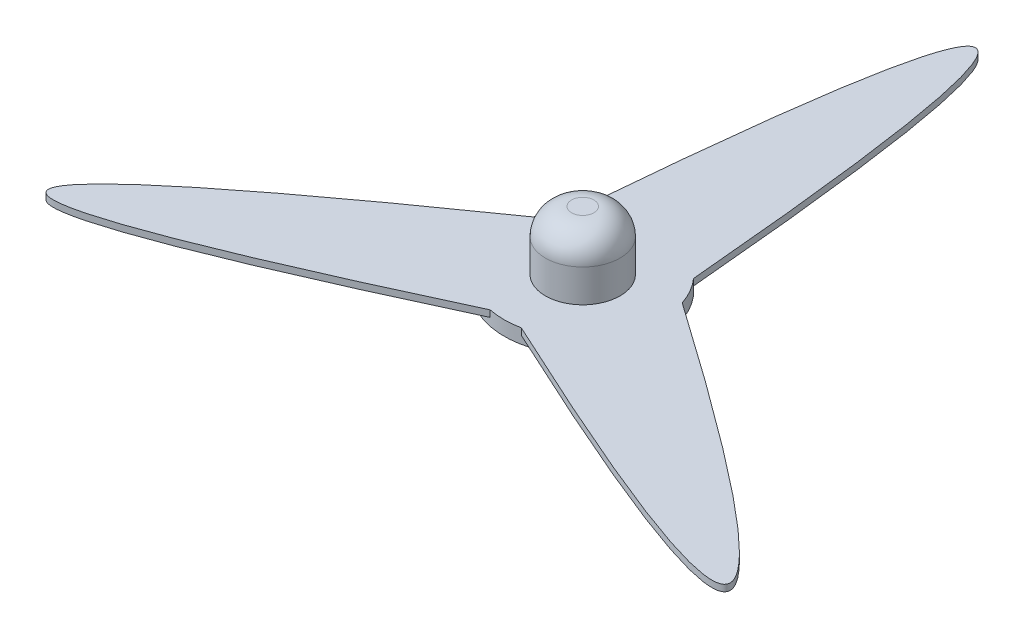
ISO-10303-21;
HEADER;
FILE_DESCRIPTION(('STEP AP214'),'2;1');
FILE_NAME('part.step','',(''),(''),'','','');
FILE_SCHEMA(('AUTOMOTIVE_DESIGN { 1 0 10303 214 1 1 1 1 }'));
ENDSEC;
DATA;
#1=APPLICATION_CONTEXT('core data for automotive mechanical design processes');
#2=APPLICATION_PROTOCOL_DEFINITION('international standard','automotive_design',2000,#1);
#3=PRODUCT_CONTEXT('',#1,'mechanical');
#4=PRODUCT('Part','Part','',(#3));
#5=PRODUCT_RELATED_PRODUCT_CATEGORY('part','',(#4));
#6=PRODUCT_DEFINITION_FORMATION('','',#4);
#7=PRODUCT_DEFINITION_CONTEXT('part definition',#1,'design');
#8=PRODUCT_DEFINITION('design','',#6,#7);
#9=PRODUCT_DEFINITION_SHAPE('','',#8);
#10=(LENGTH_UNIT() NAMED_UNIT(*) SI_UNIT(.MILLI.,.METRE.));
#11=(NAMED_UNIT(*) PLANE_ANGLE_UNIT() SI_UNIT($,.RADIAN.));
#12=(NAMED_UNIT(*) SI_UNIT($,.STERADIAN.) SOLID_ANGLE_UNIT());
#13=UNCERTAINTY_MEASURE_WITH_UNIT(LENGTH_MEASURE(1.E-05),#10,'distance_accuracy_value','');
#14=(GEOMETRIC_REPRESENTATION_CONTEXT(3) GLOBAL_UNCERTAINTY_ASSIGNED_CONTEXT((#13)) GLOBAL_UNIT_ASSIGNED_CONTEXT((#10,
#11,#12)) REPRESENTATION_CONTEXT('',''));
#15=CARTESIAN_POINT('',(0.,0.,0.));
#16=DIRECTION('',(0.,0.,1.));
#17=DIRECTION('',(1.,0.,0.));
#18=AXIS2_PLACEMENT_3D('',#15,#16,#17);
#19=CARTESIAN_POINT('',(0.,0.,-300.));
#20=DIRECTION('',(0.,1.,0.));
#21=DIRECTION('',(0.,0.,1.));
#22=AXIS2_PLACEMENT_3D('',#19,#20,#21);
#23=PLANE('',#22);
#24=CARTESIAN_POINT('',(0.,0.,0.));
#25=DIRECTION('',(0.,-1.,0.));
#26=DIRECTION('',(0.,0.,-1.));
#27=AXIS2_PLACEMENT_3D('',#24,#25,#26);
#28=CIRCLE('',#27,60.);
#29=CARTESIAN_POINT('',(56.8693177121689,0.,-19.1280083373151));
#30=VERTEX_POINT('',#29);
#31=CARTESIAN_POINT('',(11.8693177121685,0.,58.8142780032842));
#32=VERTEX_POINT('',#31);
#33=EDGE_CURVE('E11',#30,#32,#28,.T.);
#34=ORIENTED_EDGE('',*,*,#33,.F.);
#35=CARTESIAN_POINT('',(11.8693177121685,0.,58.8142780032842));
#36=CARTESIAN_POINT('',(485.245924558493,0.,280.156865167018));
#37=CARTESIAN_POINT('',(56.8693177121689,0.,-19.1280083373151));
#38=B_SPLINE_CURVE_WITH_KNOTS('',2,(#35,#36,#37),.UNSPECIFIED.,.F.,.F.,(3,3),(0.,1.),.UNSPECIFIED.);
#39=EDGE_CURVE('E142',#32,#30,#38,.T.);
#40=ORIENTED_EDGE('',*,*,#39,.F.);
#41=EDGE_LOOP('',(#34,#40));
#42=FACE_BOUND('',#41,.T.);
#43=ADVANCED_FACE('F32',(#42),#23,.F.);
#44=CARTESIAN_POINT('',(-11.8693177121693,0.,58.8142780032841));
#45=VERTEX_POINT('',#44);
#46=CARTESIAN_POINT('',(-56.8693177121686,0.,-19.1280083373158));
#47=VERTEX_POINT('',#46);
#48=EDGE_CURVE('E42',#45,#47,#28,.T.);
#49=ORIENTED_EDGE('',*,*,#48,.F.);
#50=CARTESIAN_POINT('',(-56.8693177121686,0.,-19.1280083373158));
#51=CARTESIAN_POINT('',(-485.245924558497,0.,280.156865167011));
#52=CARTESIAN_POINT('',(-11.8693177121693,0.,58.8142780032841));
#53=B_SPLINE_CURVE_WITH_KNOTS('',2,(#50,#51,#52),.UNSPECIFIED.,.F.,.F.,(3,3),(0.,1.),.UNSPECIFIED.);
#54=EDGE_CURVE('E209',#47,#45,#53,.T.);
#55=ORIENTED_EDGE('',*,*,#54,.F.);
#56=EDGE_LOOP('',(#49,#55));
#57=FACE_BOUND('',#56,.T.);
#58=ADVANCED_FACE('F182',(#57),#23,.F.);
#59=CARTESIAN_POINT('',(-45.,0.,-39.6862696659689));
#60=VERTEX_POINT('',#59);
#61=CARTESIAN_POINT('',(45.,0.,-39.6862696659689));
#62=VERTEX_POINT('',#61);
#63=EDGE_CURVE('E197',#60,#62,#28,.T.);
#64=ORIENTED_EDGE('',*,*,#63,.F.);
#65=CARTESIAN_POINT('',(45.,0.,-39.6862696659689));
#66=CARTESIAN_POINT('',(0.,0.,-560.313730334031));
#67=CARTESIAN_POINT('',(-45.,0.,-39.6862696659689));
#68=B_SPLINE_CURVE_WITH_KNOTS('',2,(#65,#66,#67),.UNSPECIFIED.,.F.,.F.,(3,3),(0.,1.),.UNSPECIFIED.);
#69=EDGE_CURVE('E149',#62,#60,#68,.T.);
#70=ORIENTED_EDGE('',*,*,#69,.F.);
#71=EDGE_LOOP('',(#64,#70));
#72=FACE_BOUND('',#71,.T.);
#73=ADVANCED_FACE('F183',(#72),#23,.F.);
#74=CARTESIAN_POINT('',(0.,30.,0.));
#75=DIRECTION('',(0.,1.,0.));
#76=DIRECTION('',(0.,0.,1.));
#77=AXIS2_PLACEMENT_3D('',#74,#75,#76);
#78=DEGENERATE_TOROIDAL_SURFACE('',#77,8.5,20.,.T.);
#79=CARTESIAN_POINT('',(0.,50.,0.));
#80=DIRECTION('',(0.,1.,0.));
#81=DIRECTION('',(0.,0.,1.));
#82=AXIS2_PLACEMENT_3D('',#79,#80,#81);
#83=CIRCLE('',#82,8.5);
#84=CARTESIAN_POINT('',(0.,50.,8.5));
#85=VERTEX_POINT('',#84);
#86=EDGE_CURVE('E206',#85,#85,#83,.T.);
#87=ORIENTED_EDGE('',*,*,#86,.F.);
#88=EDGE_LOOP('',(#87));
#89=FACE_BOUND('',#88,.T.);
#90=CARTESIAN_POINT('',(0.,30.,0.));
#91=DIRECTION('',(0.,1.,0.));
#92=DIRECTION('',(0.,0.,1.));
#93=AXIS2_PLACEMENT_3D('',#90,#91,#92);
#94=CIRCLE('',#93,28.5);
#95=CARTESIAN_POINT('',(0.,30.,28.5));
#96=VERTEX_POINT('',#95);
#97=EDGE_CURVE('E200',#96,#96,#94,.F.);
#98=ORIENTED_EDGE('',*,*,#97,.F.);
#99=EDGE_LOOP('',(#98));
#100=FACE_BOUND('',#99,.T.);
#101=ADVANCED_FACE('F34',(#89,#100),#78,.T.);
#102=CARTESIAN_POINT('',(0.,5.,-300.));
#103=DIRECTION('',(0.,1.,0.));
#104=DIRECTION('',(0.,0.,1.));
#105=AXIS2_PLACEMENT_3D('',#102,#103,#104);
#106=PLANE('',#105);
#107=CARTESIAN_POINT('',(45.,5.,-39.6862696659689));
#108=CARTESIAN_POINT('',(0.,5.,-560.313730334031));
#109=CARTESIAN_POINT('',(-45.,5.,-39.6862696659689));
#110=B_SPLINE_CURVE_WITH_KNOTS('',2,(#107,#108,#109),.UNSPECIFIED.,.F.,.F.,(3,3),(0.,1.),.UNSPECIFIED.);
#111=CARTESIAN_POINT('',(45.,5.,-39.6862696659689));
#112=VERTEX_POINT('',#111);
#113=CARTESIAN_POINT('',(-45.,5.,-39.6862696659689));
#114=VERTEX_POINT('',#113);
#115=EDGE_CURVE('E137',#112,#114,#110,.T.);
#116=ORIENTED_EDGE('',*,*,#115,.T.);
#117=CARTESIAN_POINT('',(0.,5.,0.));
#118=DIRECTION('',(0.,1.,0.));
#119=DIRECTION('',(0.,0.,1.));
#120=AXIS2_PLACEMENT_3D('',#117,#118,#119);
#121=CIRCLE('',#120,60.);
#122=CARTESIAN_POINT('',(-56.8693177121686,5.,-19.1280083373158));
#123=VERTEX_POINT('',#122);
#124=EDGE_CURVE('E84',#114,#123,#121,.T.);
#125=ORIENTED_EDGE('',*,*,#124,.T.);
#126=CARTESIAN_POINT('',(-56.8693177121686,5.,-19.1280083373158));
#127=CARTESIAN_POINT('',(-485.245924558497,5.,280.156865167011));
#128=CARTESIAN_POINT('',(-11.8693177121693,5.,58.8142780032841));
#129=B_SPLINE_CURVE_WITH_KNOTS('',2,(#126,#127,#128),.UNSPECIFIED.,.F.,.F.,(3,3),(0.,1.),.UNSPECIFIED.);
#130=CARTESIAN_POINT('',(-11.8693177121693,5.,58.8142780032841));
#131=VERTEX_POINT('',#130);
#132=EDGE_CURVE('E98',#123,#131,#129,.T.);
#133=ORIENTED_EDGE('',*,*,#132,.T.);
#134=CARTESIAN_POINT('',(0.,5.,0.));
#135=DIRECTION('',(0.,1.,0.));
#136=DIRECTION('',(0.,0.,1.));
#137=AXIS2_PLACEMENT_3D('',#134,#135,#136);
#138=CIRCLE('',#137,60.);
#139=CARTESIAN_POINT('',(11.8693177121685,5.,58.8142780032842));
#140=VERTEX_POINT('',#139);
#141=EDGE_CURVE('E92',#131,#140,#138,.T.);
#142=ORIENTED_EDGE('',*,*,#141,.T.);
#143=CARTESIAN_POINT('',(11.8693177121685,5.,58.8142780032842));
#144=CARTESIAN_POINT('',(485.245924558493,5.,280.156865167018));
#145=CARTESIAN_POINT('',(56.8693177121689,5.,-19.1280083373151));
#146=B_SPLINE_CURVE_WITH_KNOTS('',2,(#143,#144,#145),.UNSPECIFIED.,.F.,.F.,(3,3),(0.,1.),.UNSPECIFIED.);
#147=CARTESIAN_POINT('',(56.8693177121689,5.,-19.1280083373151));
#148=VERTEX_POINT('',#147);
#149=EDGE_CURVE('E95',#140,#148,#146,.T.);
#150=ORIENTED_EDGE('',*,*,#149,.T.);
#151=CARTESIAN_POINT('',(0.,5.,0.));
#152=DIRECTION('',(0.,1.,0.));
#153=DIRECTION('',(0.,0.,1.));
#154=AXIS2_PLACEMENT_3D('',#151,#152,#153);
#155=CIRCLE('',#154,60.);
#156=EDGE_CURVE('E51',#148,#112,#155,.T.);
#157=ORIENTED_EDGE('',*,*,#156,.T.);
#158=EDGE_LOOP('',(#116,#125,#133,#142,#150,#157));
#159=FACE_BOUND('',#158,.T.);
#160=CARTESIAN_POINT('',(0.,5.,0.));
#161=DIRECTION('',(0.,1.,0.));
#162=DIRECTION('',(0.,0.,1.));
#163=AXIS2_PLACEMENT_3D('',#160,#161,#162);
#164=CIRCLE('',#163,28.5);
#165=CARTESIAN_POINT('',(0.,5.,28.5));
#166=VERTEX_POINT('',#165);
#167=EDGE_CURVE('E143',#166,#166,#164,.T.);
#168=ORIENTED_EDGE('',*,*,#167,.F.);
#169=EDGE_LOOP('',(#168));
#170=FACE_BOUND('',#169,.T.);
#171=ADVANCED_FACE('F93',(#159,#170),#106,.T.);
#172=DIRECTION('',(0.,-1.,0.));
#173=VECTOR('',#172,1.);
#174=SURFACE_OF_LINEAR_EXTRUSION('',#110,#173);
#175=ORIENTED_EDGE('',*,*,#69,.T.);
#176=DIRECTION('',(0.,-1.,0.));
#177=VECTOR('',#176,1.);
#178=CARTESIAN_POINT('',(-45.,5.,-39.6862696659689));
#179=LINE('',#178,#177);
#180=EDGE_CURVE('E203',#114,#60,#179,.T.);
#181=ORIENTED_EDGE('',*,*,#180,.F.);
#182=ORIENTED_EDGE('',*,*,#115,.F.);
#183=DIRECTION('',(0.,-1.,0.));
#184=VECTOR('',#183,1.);
#185=CARTESIAN_POINT('',(45.,5.,-39.6862696659689));
#186=LINE('',#185,#184);
#187=EDGE_CURVE('E110',#112,#62,#186,.T.);
#188=ORIENTED_EDGE('',*,*,#187,.T.);
#189=EDGE_LOOP('',(#175,#181,#182,#188));
#190=FACE_BOUND('',#189,.T.);
#191=ADVANCED_FACE('F127',(#190),#174,.F.);
#192=DIRECTION('',(0.,-1.,0.));
#193=VECTOR('',#192,1.);
#194=SURFACE_OF_LINEAR_EXTRUSION('',#129,#193);
#195=ORIENTED_EDGE('',*,*,#54,.T.);
#196=DIRECTION('',(0.,-1.,0.));
#197=VECTOR('',#196,1.);
#198=CARTESIAN_POINT('',(-11.8693177121693,5.,58.8142780032841));
#199=LINE('',#198,#197);
#200=EDGE_CURVE('E105',#131,#45,#199,.T.);
#201=ORIENTED_EDGE('',*,*,#200,.F.);
#202=ORIENTED_EDGE('',*,*,#132,.F.);
#203=DIRECTION('',(0.,-1.,0.));
#204=VECTOR('',#203,1.);
#205=CARTESIAN_POINT('',(-56.8693177121686,5.,-19.1280083373158));
#206=LINE('',#205,#204);
#207=EDGE_CURVE('E207',#123,#47,#206,.T.);
#208=ORIENTED_EDGE('',*,*,#207,.T.);
#209=EDGE_LOOP('',(#195,#201,#202,#208));
#210=FACE_BOUND('',#209,.T.);
#211=ADVANCED_FACE('F124',(#210),#194,.F.);
#212=DIRECTION('',(0.,-1.,0.));
#213=VECTOR('',#212,1.);
#214=SURFACE_OF_LINEAR_EXTRUSION('',#146,#213);
#215=ORIENTED_EDGE('',*,*,#39,.T.);
#216=DIRECTION('',(0.,-1.,0.));
#217=VECTOR('',#216,1.);
#218=CARTESIAN_POINT('',(56.8693177121689,5.,-19.1280083373151));
#219=LINE('',#218,#217);
#220=EDGE_CURVE('E106',#148,#30,#219,.T.);
#221=ORIENTED_EDGE('',*,*,#220,.F.);
#222=ORIENTED_EDGE('',*,*,#149,.F.);
#223=DIRECTION('',(0.,-1.,0.));
#224=VECTOR('',#223,1.);
#225=CARTESIAN_POINT('',(11.8693177121685,5.,58.8142780032842));
#226=LINE('',#225,#224);
#227=EDGE_CURVE('E72',#140,#32,#226,.T.);
#228=ORIENTED_EDGE('',*,*,#227,.T.);
#229=EDGE_LOOP('',(#215,#221,#222,#228));
#230=FACE_BOUND('',#229,.T.);
#231=ADVANCED_FACE('F108',(#230),#214,.F.);
#232=CARTESIAN_POINT('',(0.,5.,0.));
#233=DIRECTION('',(0.,-1.,0.));
#234=DIRECTION('',(0.,0.,-1.));
#235=AXIS2_PLACEMENT_3D('',#232,#233,#234);
#236=CYLINDRICAL_SURFACE('',#235,60.);
#237=ORIENTED_EDGE('',*,*,#220,.T.);
#238=ORIENTED_EDGE('',*,*,#33,.T.);
#239=ORIENTED_EDGE('',*,*,#227,.F.);
#240=ORIENTED_EDGE('',*,*,#141,.F.);
#241=ORIENTED_EDGE('',*,*,#200,.T.);
#242=ORIENTED_EDGE('',*,*,#48,.T.);
#243=ORIENTED_EDGE('',*,*,#207,.F.);
#244=ORIENTED_EDGE('',*,*,#124,.F.);
#245=ORIENTED_EDGE('',*,*,#180,.T.);
#246=ORIENTED_EDGE('',*,*,#63,.T.);
#247=ORIENTED_EDGE('',*,*,#187,.F.);
#248=ORIENTED_EDGE('',*,*,#156,.F.);
#249=EDGE_LOOP('',(#237,#238,#239,#240,#241,#242,#243,#244,#245,#246,#247,#248));
#250=FACE_BOUND('',#249,.T.);
#251=CARTESIAN_POINT('',(0.,-6.,0.));
#252=DIRECTION('',(0.,-1.,0.));
#253=DIRECTION('',(0.,0.,-1.));
#254=AXIS2_PLACEMENT_3D('',#251,#252,#253);
#255=CIRCLE('',#254,60.);
#256=CARTESIAN_POINT('',(0.,-6.,-60.));
#257=VERTEX_POINT('',#256);
#258=EDGE_CURVE('E150',#257,#257,#255,.T.);
#259=ORIENTED_EDGE('',*,*,#258,.F.);
#260=EDGE_LOOP('',(#259));
#261=FACE_BOUND('',#260,.T.);
#262=ADVANCED_FACE('F103',(#250,#261),#236,.T.);
#263=CARTESIAN_POINT('',(0.,50.,0.));
#264=DIRECTION('',(0.,-1.,0.));
#265=DIRECTION('',(0.,0.,-1.));
#266=AXIS2_PLACEMENT_3D('',#263,#264,#265);
#267=CYLINDRICAL_SURFACE('',#266,28.5);
#268=ORIENTED_EDGE('',*,*,#97,.T.);
#269=EDGE_LOOP('',(#268));
#270=FACE_BOUND('',#269,.T.);
#271=ORIENTED_EDGE('',*,*,#167,.T.);
#272=EDGE_LOOP('',(#271));
#273=FACE_BOUND('',#272,.T.);
#274=ADVANCED_FACE('F175',(#270,#273),#267,.T.);
#275=CARTESIAN_POINT('',(0.,50.,0.));
#276=DIRECTION('',(0.,1.,0.));
#277=DIRECTION('',(0.,0.,1.));
#278=AXIS2_PLACEMENT_3D('',#275,#276,#277);
#279=PLANE('',#278);
#280=ORIENTED_EDGE('',*,*,#86,.T.);
#281=EDGE_LOOP('',(#280));
#282=FACE_BOUND('',#281,.T.);
#283=ADVANCED_FACE('F171',(#282),#279,.T.);
#284=CARTESIAN_POINT('',(0.,-6.,0.));
#285=DIRECTION('',(0.,-1.,0.));
#286=DIRECTION('',(0.,0.,-1.));
#287=AXIS2_PLACEMENT_3D('',#284,#285,#286);
#288=PLANE('',#287);
#289=CARTESIAN_POINT('',(0.,-6.,0.));
#290=DIRECTION('',(0.,-1.,0.));
#291=DIRECTION('',(0.,0.,-1.));
#292=AXIS2_PLACEMENT_3D('',#289,#290,#291);
#293=CIRCLE('',#292,24.);
#294=CARTESIAN_POINT('',(0.,-6.,-24.));
#295=VERTEX_POINT('',#294);
#296=EDGE_CURVE('E154',#295,#295,#293,.T.);
#297=ORIENTED_EDGE('',*,*,#296,.F.);
#298=EDGE_LOOP('',(#297));
#299=FACE_BOUND('',#298,.T.);
#300=ORIENTED_EDGE('',*,*,#258,.T.);
#301=EDGE_LOOP('',(#300));
#302=FACE_BOUND('',#301,.T.);
#303=ADVANCED_FACE('F165',(#299,#302),#288,.T.);
#304=CARTESIAN_POINT('',(0.,30.,0.));
#305=DIRECTION('',(0.,-1.,0.));
#306=DIRECTION('',(0.,0.,-1.));
#307=AXIS2_PLACEMENT_3D('',#304,#305,#306);
#308=CYLINDRICAL_SURFACE('',#307,24.);
#309=CARTESIAN_POINT('',(0.,30.,0.));
#310=DIRECTION('',(0.,-1.,0.));
#311=DIRECTION('',(0.,0.,-1.));
#312=AXIS2_PLACEMENT_3D('',#309,#310,#311);
#313=CIRCLE('',#312,24.);
#314=CARTESIAN_POINT('',(0.,30.,-24.));
#315=VERTEX_POINT('',#314);
#316=EDGE_CURVE('E153',#315,#315,#313,.T.);
#317=ORIENTED_EDGE('',*,*,#316,.F.);
#318=EDGE_LOOP('',(#317));
#319=FACE_BOUND('',#318,.T.);
#320=ORIENTED_EDGE('',*,*,#296,.T.);
#321=EDGE_LOOP('',(#320));
#322=FACE_BOUND('',#321,.T.);
#323=ADVANCED_FACE('F162',(#319,#322),#308,.F.);
#324=CARTESIAN_POINT('',(0.,30.,0.));
#325=DIRECTION('',(0.,-1.,0.));
#326=DIRECTION('',(0.,0.,-1.));
#327=AXIS2_PLACEMENT_3D('',#324,#325,#326);
#328=PLANE('',#327);
#329=ORIENTED_EDGE('',*,*,#316,.T.);
#330=EDGE_LOOP('',(#329));
#331=FACE_BOUND('',#330,.T.);
#332=ADVANCED_FACE('F160',(#331),#328,.T.);
#333=CLOSED_SHELL('',(#43,#58,#73,#101,#171,#191,#211,#231,#262,#274,#283,#303,#323,#332));
#334=MANIFOLD_SOLID_BREP('B2',#333);
#335=ADVANCED_BREP_SHAPE_REPRESENTATION('',(#18,#334),#14);
#336=SHAPE_DEFINITION_REPRESENTATION(#9,#335);
ENDSEC;
END-ISO-10303-21;
